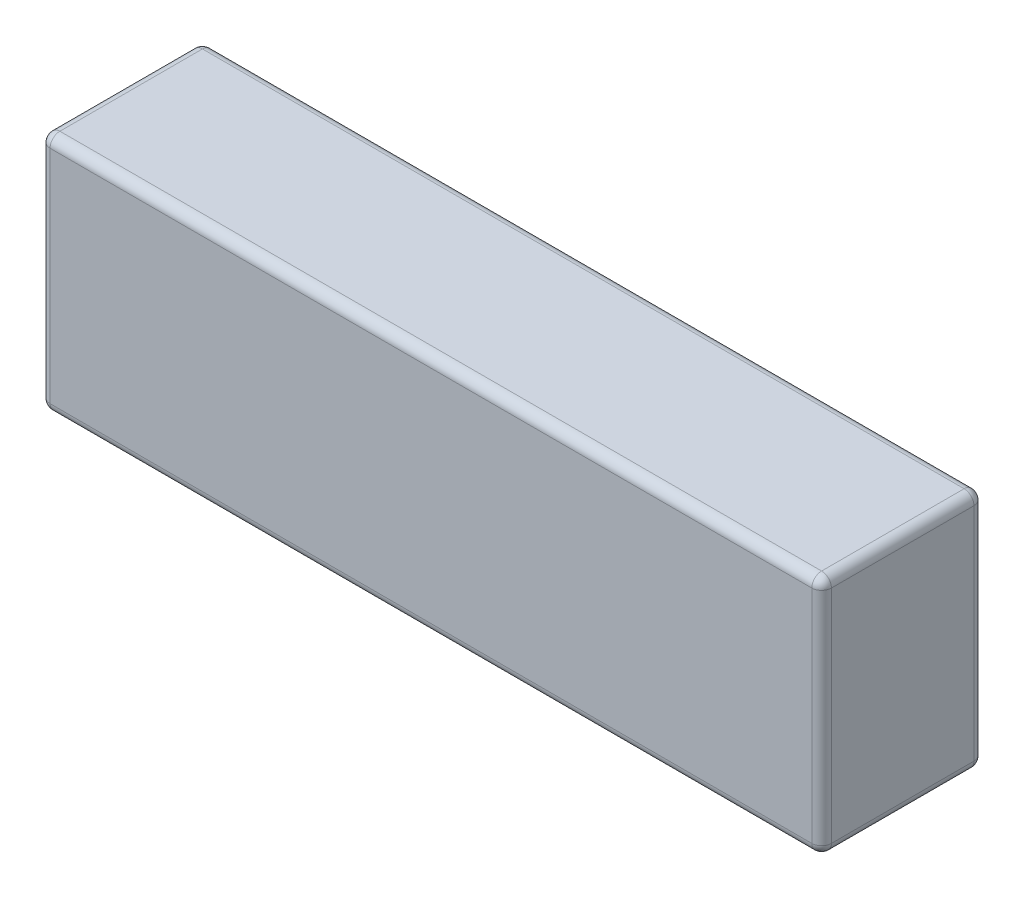
ISO-10303-21;
HEADER;
FILE_DESCRIPTION(('STEP AP214'),'2;1');
FILE_NAME('part.step','',(''),(''),'','','');
FILE_SCHEMA(('AUTOMOTIVE_DESIGN { 1 0 10303 214 1 1 1 1 }'));
ENDSEC;
DATA;
#1=APPLICATION_CONTEXT('core data for automotive mechanical design processes');
#2=APPLICATION_PROTOCOL_DEFINITION('international standard','automotive_design',2000,#1);
#3=PRODUCT_CONTEXT('',#1,'mechanical');
#4=PRODUCT('Part','Part','',(#3));
#5=PRODUCT_RELATED_PRODUCT_CATEGORY('part','',(#4));
#6=PRODUCT_DEFINITION_FORMATION('','',#4);
#7=PRODUCT_DEFINITION_CONTEXT('part definition',#1,'design');
#8=PRODUCT_DEFINITION('design','',#6,#7);
#9=PRODUCT_DEFINITION_SHAPE('','',#8);
#10=(LENGTH_UNIT() NAMED_UNIT(*) SI_UNIT(.MILLI.,.METRE.));
#11=(NAMED_UNIT(*) PLANE_ANGLE_UNIT() SI_UNIT($,.RADIAN.));
#12=(NAMED_UNIT(*) SI_UNIT($,.STERADIAN.) SOLID_ANGLE_UNIT());
#13=UNCERTAINTY_MEASURE_WITH_UNIT(LENGTH_MEASURE(1.E-05),#10,'distance_accuracy_value','');
#14=(GEOMETRIC_REPRESENTATION_CONTEXT(3) GLOBAL_UNCERTAINTY_ASSIGNED_CONTEXT((#13)) GLOBAL_UNIT_ASSIGNED_CONTEXT((#10,
#11,#12)) REPRESENTATION_CONTEXT('',''));
#15=CARTESIAN_POINT('',(0.,0.,0.));
#16=DIRECTION('',(0.,0.,1.));
#17=DIRECTION('',(1.,0.,0.));
#18=AXIS2_PLACEMENT_3D('',#15,#16,#17);
#19=CARTESIAN_POINT('',(0.,49.,0.));
#20=DIRECTION('',(1.,0.,0.));
#21=DIRECTION('',(0.,0.,-1.));
#22=AXIS2_PLACEMENT_3D('',#19,#20,#21);
#23=PLANE('',#22);
#24=DIRECTION('',(0.,0.,1.));
#25=VECTOR('',#24,1.);
#26=CARTESIAN_POINT('',(0.,2.,0.));
#27=LINE('',#26,#25);
#28=CARTESIAN_POINT('',(0.,2.,-31.));
#29=VERTEX_POINT('',#28);
#30=CARTESIAN_POINT('',(0.,2.,-2.));
#31=VERTEX_POINT('',#30);
#32=EDGE_CURVE('E171',#29,#31,#27,.T.);
#33=ORIENTED_EDGE('',*,*,#32,.T.);
#34=DIRECTION('',(0.,-1.,0.));
#35=VECTOR('',#34,1.);
#36=CARTESIAN_POINT('',(0.,49.,-2.));
#37=LINE('',#36,#35);
#38=CARTESIAN_POINT('',(0.,47.,-2.));
#39=VERTEX_POINT('',#38);
#40=EDGE_CURVE('E173',#31,#39,#37,.F.);
#41=ORIENTED_EDGE('',*,*,#40,.T.);
#42=DIRECTION('',(0.,0.,1.));
#43=VECTOR('',#42,1.);
#44=CARTESIAN_POINT('',(0.,47.,0.));
#45=LINE('',#44,#43);
#46=CARTESIAN_POINT('',(0.,47.,-31.));
#47=VERTEX_POINT('',#46);
#48=EDGE_CURVE('E169',#39,#47,#45,.F.);
#49=ORIENTED_EDGE('',*,*,#48,.T.);
#50=DIRECTION('',(0.,-1.,0.));
#51=VECTOR('',#50,1.);
#52=CARTESIAN_POINT('',(0.,49.,-31.));
#53=LINE('',#52,#51);
#54=EDGE_CURVE('E167',#47,#29,#53,.T.);
#55=ORIENTED_EDGE('',*,*,#54,.T.);
#56=EDGE_LOOP('',(#33,#41,#49,#55));
#57=FACE_BOUND('',#56,.T.);
#58=ADVANCED_FACE('F35',(#57),#23,.F.);
#59=CARTESIAN_POINT('',(0.,49.,0.));
#60=DIRECTION('',(0.,0.,-1.));
#61=DIRECTION('',(-1.,0.,0.));
#62=AXIS2_PLACEMENT_3D('',#59,#60,#61);
#63=PLANE('',#62);
#64=DIRECTION('',(0.,-1.,0.));
#65=VECTOR('',#64,1.);
#66=CARTESIAN_POINT('',(2.,49.,0.));
#67=LINE('',#66,#65);
#68=CARTESIAN_POINT('',(2.,47.,0.));
#69=VERTEX_POINT('',#68);
#70=CARTESIAN_POINT('',(2.,2.,0.));
#71=VERTEX_POINT('',#70);
#72=EDGE_CURVE('E134',#69,#71,#67,.T.);
#73=ORIENTED_EDGE('',*,*,#72,.T.);
#74=DIRECTION('',(1.,0.,0.));
#75=VECTOR('',#74,1.);
#76=CARTESIAN_POINT('',(159.,2.,0.));
#77=LINE('',#76,#75);
#78=CARTESIAN_POINT('',(157.,2.,0.));
#79=VERTEX_POINT('',#78);
#80=EDGE_CURVE('E130',#71,#79,#77,.T.);
#81=ORIENTED_EDGE('',*,*,#80,.T.);
#82=DIRECTION('',(0.,-1.,0.));
#83=VECTOR('',#82,1.);
#84=CARTESIAN_POINT('',(157.,49.,0.));
#85=LINE('',#84,#83);
#86=CARTESIAN_POINT('',(157.,47.,0.));
#87=VERTEX_POINT('',#86);
#88=EDGE_CURVE('E122',#79,#87,#85,.F.);
#89=ORIENTED_EDGE('',*,*,#88,.T.);
#90=DIRECTION('',(1.,0.,0.));
#91=VECTOR('',#90,1.);
#92=CARTESIAN_POINT('',(0.,47.,0.));
#93=LINE('',#92,#91);
#94=EDGE_CURVE('E127',#87,#69,#93,.F.);
#95=ORIENTED_EDGE('',*,*,#94,.T.);
#96=EDGE_LOOP('',(#73,#81,#89,#95));
#97=FACE_BOUND('',#96,.T.);
#98=ADVANCED_FACE('F125',(#97),#63,.F.);
#99=CARTESIAN_POINT('',(159.,49.,0.));
#100=DIRECTION('',(-1.,0.,0.));
#101=DIRECTION('',(0.,0.,1.));
#102=AXIS2_PLACEMENT_3D('',#99,#100,#101);
#103=PLANE('',#102);
#104=DIRECTION('',(0.,0.,-1.));
#105=VECTOR('',#104,1.);
#106=CARTESIAN_POINT('',(159.,47.,0.));
#107=LINE('',#106,#105);
#108=CARTESIAN_POINT('',(159.,47.,-31.));
#109=VERTEX_POINT('',#108);
#110=CARTESIAN_POINT('',(159.,47.,-2.));
#111=VERTEX_POINT('',#110);
#112=EDGE_CURVE('E178',#109,#111,#107,.F.);
#113=ORIENTED_EDGE('',*,*,#112,.T.);
#114=DIRECTION('',(0.,-1.,0.));
#115=VECTOR('',#114,1.);
#116=CARTESIAN_POINT('',(159.,49.,-2.));
#117=LINE('',#116,#115);
#118=CARTESIAN_POINT('',(159.,2.,-2.));
#119=VERTEX_POINT('',#118);
#120=EDGE_CURVE('E142',#111,#119,#117,.T.);
#121=ORIENTED_EDGE('',*,*,#120,.T.);
#122=DIRECTION('',(0.,0.,-1.));
#123=VECTOR('',#122,1.);
#124=CARTESIAN_POINT('',(159.,2.,-33.));
#125=LINE('',#124,#123);
#126=CARTESIAN_POINT('',(159.,2.,-31.));
#127=VERTEX_POINT('',#126);
#128=EDGE_CURVE('E180',#119,#127,#125,.T.);
#129=ORIENTED_EDGE('',*,*,#128,.T.);
#130=DIRECTION('',(0.,-1.,0.));
#131=VECTOR('',#130,1.);
#132=CARTESIAN_POINT('',(159.,49.,-31.));
#133=LINE('',#132,#131);
#134=EDGE_CURVE('E176',#127,#109,#133,.F.);
#135=ORIENTED_EDGE('',*,*,#134,.T.);
#136=EDGE_LOOP('',(#113,#121,#129,#135));
#137=FACE_BOUND('',#136,.T.);
#138=ADVANCED_FACE('F334',(#137),#103,.F.);
#139=CARTESIAN_POINT('',(0.,49.,-33.));
#140=DIRECTION('',(0.,0.,1.));
#141=DIRECTION('',(1.,0.,0.));
#142=AXIS2_PLACEMENT_3D('',#139,#140,#141);
#143=PLANE('',#142);
#144=DIRECTION('',(-1.,0.,0.));
#145=VECTOR('',#144,1.);
#146=CARTESIAN_POINT('',(0.,47.,-33.));
#147=LINE('',#146,#145);
#148=CARTESIAN_POINT('',(2.,47.,-33.));
#149=VERTEX_POINT('',#148);
#150=CARTESIAN_POINT('',(157.,47.,-33.));
#151=VERTEX_POINT('',#150);
#152=EDGE_CURVE('E44',#149,#151,#147,.F.);
#153=ORIENTED_EDGE('',*,*,#152,.T.);
#154=DIRECTION('',(0.,-1.,0.));
#155=VECTOR('',#154,1.);
#156=CARTESIAN_POINT('',(157.,49.,-33.));
#157=LINE('',#156,#155);
#158=CARTESIAN_POINT('',(157.,2.,-33.));
#159=VERTEX_POINT('',#158);
#160=EDGE_CURVE('E11',#151,#159,#157,.T.);
#161=ORIENTED_EDGE('',*,*,#160,.T.);
#162=DIRECTION('',(-1.,0.,0.));
#163=VECTOR('',#162,1.);
#164=CARTESIAN_POINT('',(0.,2.,-33.));
#165=LINE('',#164,#163);
#166=CARTESIAN_POINT('',(2.,2.,-33.));
#167=VERTEX_POINT('',#166);
#168=EDGE_CURVE('E201',#159,#167,#165,.T.);
#169=ORIENTED_EDGE('',*,*,#168,.T.);
#170=DIRECTION('',(0.,-1.,0.));
#171=VECTOR('',#170,1.);
#172=CARTESIAN_POINT('',(2.,49.,-33.));
#173=LINE('',#172,#171);
#174=EDGE_CURVE('E55',#167,#149,#173,.F.);
#175=ORIENTED_EDGE('',*,*,#174,.T.);
#176=EDGE_LOOP('',(#153,#161,#169,#175));
#177=FACE_BOUND('',#176,.T.);
#178=ADVANCED_FACE('F274',(#177),#143,.F.);
#179=CARTESIAN_POINT('',(0.,49.,-33.));
#180=DIRECTION('',(0.,-1.,0.));
#181=DIRECTION('',(0.,0.,-1.));
#182=AXIS2_PLACEMENT_3D('',#179,#180,#181);
#183=PLANE('',#182);
#184=DIRECTION('',(1.,0.,0.));
#185=VECTOR('',#184,1.);
#186=CARTESIAN_POINT('',(0.,49.,-2.));
#187=LINE('',#186,#185);
#188=CARTESIAN_POINT('',(2.,49.,-2.));
#189=VERTEX_POINT('',#188);
#190=CARTESIAN_POINT('',(157.,49.,-2.));
#191=VERTEX_POINT('',#190);
#192=EDGE_CURVE('E196',#189,#191,#187,.T.);
#193=ORIENTED_EDGE('',*,*,#192,.T.);
#194=DIRECTION('',(0.,0.,-1.));
#195=VECTOR('',#194,1.);
#196=CARTESIAN_POINT('',(157.,49.,-33.));
#197=LINE('',#196,#195);
#198=CARTESIAN_POINT('',(157.,49.,-31.));
#199=VERTEX_POINT('',#198);
#200=EDGE_CURVE('E198',#191,#199,#197,.T.);
#201=ORIENTED_EDGE('',*,*,#200,.T.);
#202=DIRECTION('',(-1.,0.,0.));
#203=VECTOR('',#202,1.);
#204=CARTESIAN_POINT('',(0.,49.,-31.));
#205=LINE('',#204,#203);
#206=CARTESIAN_POINT('',(2.,49.,-31.));
#207=VERTEX_POINT('',#206);
#208=EDGE_CURVE('E192',#199,#207,#205,.T.);
#209=ORIENTED_EDGE('',*,*,#208,.T.);
#210=DIRECTION('',(0.,0.,1.));
#211=VECTOR('',#210,1.);
#212=CARTESIAN_POINT('',(2.,49.,-33.));
#213=LINE('',#212,#211);
#214=EDGE_CURVE('E194',#207,#189,#213,.T.);
#215=ORIENTED_EDGE('',*,*,#214,.T.);
#216=EDGE_LOOP('',(#193,#201,#209,#215));
#217=FACE_BOUND('',#216,.T.);
#218=ADVANCED_FACE('F298',(#217),#183,.F.);
#219=CARTESIAN_POINT('',(0.,0.,-33.));
#220=DIRECTION('',(0.,-1.,0.));
#221=DIRECTION('',(0.,0.,-1.));
#222=AXIS2_PLACEMENT_3D('',#219,#220,#221);
#223=PLANE('',#222);
#224=DIRECTION('',(0.,0.,-1.));
#225=VECTOR('',#224,1.);
#226=CARTESIAN_POINT('',(157.,0.,0.));
#227=LINE('',#226,#225);
#228=CARTESIAN_POINT('',(157.,0.,-31.));
#229=VERTEX_POINT('',#228);
#230=CARTESIAN_POINT('',(157.,0.,-2.));
#231=VERTEX_POINT('',#230);
#232=EDGE_CURVE('E187',#229,#231,#227,.F.);
#233=ORIENTED_EDGE('',*,*,#232,.T.);
#234=DIRECTION('',(1.,0.,0.));
#235=VECTOR('',#234,1.);
#236=CARTESIAN_POINT('',(0.,0.,-2.));
#237=LINE('',#236,#235);
#238=CARTESIAN_POINT('',(2.,0.,-2.));
#239=VERTEX_POINT('',#238);
#240=EDGE_CURVE('E189',#231,#239,#237,.F.);
#241=ORIENTED_EDGE('',*,*,#240,.T.);
#242=DIRECTION('',(0.,0.,1.));
#243=VECTOR('',#242,1.);
#244=CARTESIAN_POINT('',(2.,0.,-33.));
#245=LINE('',#244,#243);
#246=CARTESIAN_POINT('',(2.,0.,-31.));
#247=VERTEX_POINT('',#246);
#248=EDGE_CURVE('E185',#239,#247,#245,.F.);
#249=ORIENTED_EDGE('',*,*,#248,.T.);
#250=DIRECTION('',(-1.,0.,0.));
#251=VECTOR('',#250,1.);
#252=CARTESIAN_POINT('',(159.,0.,-31.));
#253=LINE('',#252,#251);
#254=EDGE_CURVE('E183',#247,#229,#253,.F.);
#255=ORIENTED_EDGE('',*,*,#254,.T.);
#256=EDGE_LOOP('',(#233,#241,#249,#255));
#257=FACE_BOUND('',#256,.T.);
#258=ADVANCED_FACE('F267',(#257),#223,.T.);
#259=CARTESIAN_POINT('',(157.,49.,-31.));
#260=DIRECTION('',(0.,-1.,0.));
#261=DIRECTION('',(0.,0.,-1.));
#262=AXIS2_PLACEMENT_3D('',#259,#260,#261);
#263=CYLINDRICAL_SURFACE('',#262,2.);
#264=CARTESIAN_POINT('',(157.,47.,-31.));
#265=DIRECTION('',(0.,1.,0.));
#266=DIRECTION('',(0.,0.,1.));
#267=AXIS2_PLACEMENT_3D('',#264,#265,#266);
#268=CIRCLE('',#267,2.);
#269=EDGE_CURVE('E39',#109,#151,#268,.T.);
#270=ORIENTED_EDGE('',*,*,#269,.F.);
#271=ORIENTED_EDGE('',*,*,#134,.F.);
#272=CARTESIAN_POINT('',(157.,2.,-31.));
#273=DIRECTION('',(0.,-1.,0.));
#274=DIRECTION('',(0.,0.,-1.));
#275=AXIS2_PLACEMENT_3D('',#272,#273,#274);
#276=CIRCLE('',#275,2.);
#277=EDGE_CURVE('E163',#159,#127,#276,.T.);
#278=ORIENTED_EDGE('',*,*,#277,.F.);
#279=ORIENTED_EDGE('',*,*,#160,.F.);
#280=EDGE_LOOP('',(#270,#271,#278,#279));
#281=FACE_BOUND('',#280,.T.);
#282=ADVANCED_FACE('F37',(#281),#263,.T.);
#283=CARTESIAN_POINT('',(157.,47.,-31.));
#284=DIRECTION('',(0.,0.,1.));
#285=DIRECTION('',(1.,0.,0.));
#286=AXIS2_PLACEMENT_3D('',#283,#284,#285);
#287=SPHERICAL_SURFACE('',#286,2.);
#288=CARTESIAN_POINT('',(157.,47.,-31.));
#289=DIRECTION('',(0.,0.,-1.));
#290=DIRECTION('',(-1.,0.,0.));
#291=AXIS2_PLACEMENT_3D('',#288,#289,#290);
#292=CIRCLE('',#291,2.);
#293=EDGE_CURVE('E247',#109,#199,#292,.F.);
#294=ORIENTED_EDGE('',*,*,#293,.F.);
#295=ORIENTED_EDGE('',*,*,#269,.T.);
#296=CARTESIAN_POINT('',(157.,47.,-31.));
#297=DIRECTION('',(1.,0.,0.));
#298=DIRECTION('',(0.,0.,-1.));
#299=AXIS2_PLACEMENT_3D('',#296,#297,#298);
#300=CIRCLE('',#299,2.);
#301=EDGE_CURVE('E250',#199,#151,#300,.F.);
#302=ORIENTED_EDGE('',*,*,#301,.F.);
#303=EDGE_LOOP('',(#294,#295,#302));
#304=FACE_BOUND('',#303,.T.);
#305=ADVANCED_FACE('F291',(#304),#287,.T.);
#306=CARTESIAN_POINT('',(157.,2.,-31.));
#307=DIRECTION('',(0.,0.,1.));
#308=DIRECTION('',(1.,0.,0.));
#309=AXIS2_PLACEMENT_3D('',#306,#307,#308);
#310=SPHERICAL_SURFACE('',#309,2.);
#311=CARTESIAN_POINT('',(157.,2.,-31.));
#312=DIRECTION('',(1.,0.,0.));
#313=DIRECTION('',(0.,0.,-1.));
#314=AXIS2_PLACEMENT_3D('',#311,#312,#313);
#315=CIRCLE('',#314,2.);
#316=EDGE_CURVE('E241',#159,#229,#315,.F.);
#317=ORIENTED_EDGE('',*,*,#316,.F.);
#318=ORIENTED_EDGE('',*,*,#277,.T.);
#319=CARTESIAN_POINT('',(157.,2.,-31.));
#320=DIRECTION('',(0.,0.,-1.));
#321=DIRECTION('',(-1.,0.,0.));
#322=AXIS2_PLACEMENT_3D('',#319,#320,#321);
#323=CIRCLE('',#322,2.);
#324=EDGE_CURVE('E244',#229,#127,#323,.F.);
#325=ORIENTED_EDGE('',*,*,#324,.F.);
#326=EDGE_LOOP('',(#317,#318,#325));
#327=FACE_BOUND('',#326,.T.);
#328=ADVANCED_FACE('F257',(#327),#310,.T.);
#329=CARTESIAN_POINT('',(0.,47.,-31.));
#330=DIRECTION('',(-1.,0.,0.));
#331=DIRECTION('',(0.,0.,1.));
#332=AXIS2_PLACEMENT_3D('',#329,#330,#331);
#333=CYLINDRICAL_SURFACE('',#332,2.);
#334=ORIENTED_EDGE('',*,*,#301,.T.);
#335=ORIENTED_EDGE('',*,*,#152,.F.);
#336=CARTESIAN_POINT('',(2.,47.,-31.));
#337=DIRECTION('',(-1.,0.,0.));
#338=DIRECTION('',(0.,0.,1.));
#339=AXIS2_PLACEMENT_3D('',#336,#337,#338);
#340=CIRCLE('',#339,2.);
#341=EDGE_CURVE('E235',#207,#149,#340,.T.);
#342=ORIENTED_EDGE('',*,*,#341,.F.);
#343=ORIENTED_EDGE('',*,*,#208,.F.);
#344=EDGE_LOOP('',(#334,#335,#342,#343));
#345=FACE_BOUND('',#344,.T.);
#346=ADVANCED_FACE('F287',(#345),#333,.T.);
#347=CARTESIAN_POINT('',(157.,47.,-33.));
#348=DIRECTION('',(0.,0.,-1.));
#349=DIRECTION('',(-1.,0.,0.));
#350=AXIS2_PLACEMENT_3D('',#347,#348,#349);
#351=CYLINDRICAL_SURFACE('',#350,2.);
#352=ORIENTED_EDGE('',*,*,#293,.T.);
#353=ORIENTED_EDGE('',*,*,#200,.F.);
#354=CARTESIAN_POINT('',(157.,47.,-2.));
#355=DIRECTION('',(0.,0.,1.));
#356=DIRECTION('',(0.,-1.,0.));
#357=AXIS2_PLACEMENT_3D('',#354,#355,#356);
#358=CIRCLE('',#357,2.);
#359=EDGE_CURVE('E146',#111,#191,#358,.T.);
#360=ORIENTED_EDGE('',*,*,#359,.F.);
#361=ORIENTED_EDGE('',*,*,#112,.F.);
#362=EDGE_LOOP('',(#352,#353,#360,#361));
#363=FACE_BOUND('',#362,.T.);
#364=ADVANCED_FACE('F296',(#363),#351,.T.);
#365=CARTESIAN_POINT('',(157.,49.,-2.));
#366=DIRECTION('',(0.,-1.,0.));
#367=DIRECTION('',(0.,0.,-1.));
#368=AXIS2_PLACEMENT_3D('',#365,#366,#367);
#369=CYLINDRICAL_SURFACE('',#368,2.);
#370=CARTESIAN_POINT('',(157.,2.,-2.));
#371=DIRECTION('',(0.,-1.,0.));
#372=DIRECTION('',(0.,0.,-1.));
#373=AXIS2_PLACEMENT_3D('',#370,#371,#372);
#374=CIRCLE('',#373,2.);
#375=EDGE_CURVE('E147',#119,#79,#374,.T.);
#376=ORIENTED_EDGE('',*,*,#375,.F.);
#377=ORIENTED_EDGE('',*,*,#120,.F.);
#378=CARTESIAN_POINT('',(157.,47.,-2.));
#379=DIRECTION('',(0.,1.,0.));
#380=DIRECTION('',(0.,0.,1.));
#381=AXIS2_PLACEMENT_3D('',#378,#379,#380);
#382=CIRCLE('',#381,2.);
#383=EDGE_CURVE('E138',#87,#111,#382,.T.);
#384=ORIENTED_EDGE('',*,*,#383,.F.);
#385=ORIENTED_EDGE('',*,*,#88,.F.);
#386=EDGE_LOOP('',(#376,#377,#384,#385));
#387=FACE_BOUND('',#386,.T.);
#388=ADVANCED_FACE('F140',(#387),#369,.T.);
#389=CARTESIAN_POINT('',(157.,2.,0.));
#390=DIRECTION('',(0.,0.,1.));
#391=DIRECTION('',(1.,0.,0.));
#392=AXIS2_PLACEMENT_3D('',#389,#390,#391);
#393=CYLINDRICAL_SURFACE('',#392,2.);
#394=ORIENTED_EDGE('',*,*,#324,.T.);
#395=ORIENTED_EDGE('',*,*,#128,.F.);
#396=CARTESIAN_POINT('',(157.,2.,-2.));
#397=DIRECTION('',(0.,0.,1.));
#398=DIRECTION('',(1.,0.,0.));
#399=AXIS2_PLACEMENT_3D('',#396,#397,#398);
#400=CIRCLE('',#399,2.);
#401=EDGE_CURVE('E231',#231,#119,#400,.T.);
#402=ORIENTED_EDGE('',*,*,#401,.F.);
#403=ORIENTED_EDGE('',*,*,#232,.F.);
#404=EDGE_LOOP('',(#394,#395,#402,#403));
#405=FACE_BOUND('',#404,.T.);
#406=ADVANCED_FACE('F263',(#405),#393,.T.);
#407=CARTESIAN_POINT('',(0.,2.,-31.));
#408=DIRECTION('',(1.,0.,0.));
#409=DIRECTION('',(0.,0.,-1.));
#410=AXIS2_PLACEMENT_3D('',#407,#408,#409);
#411=CYLINDRICAL_SURFACE('',#410,2.);
#412=ORIENTED_EDGE('',*,*,#316,.T.);
#413=ORIENTED_EDGE('',*,*,#254,.F.);
#414=CARTESIAN_POINT('',(2.,2.,-31.));
#415=DIRECTION('',(-1.,0.,0.));
#416=DIRECTION('',(0.,0.,1.));
#417=AXIS2_PLACEMENT_3D('',#414,#415,#416);
#418=CIRCLE('',#417,2.);
#419=EDGE_CURVE('E228',#167,#247,#418,.T.);
#420=ORIENTED_EDGE('',*,*,#419,.F.);
#421=ORIENTED_EDGE('',*,*,#168,.F.);
#422=EDGE_LOOP('',(#412,#413,#420,#421));
#423=FACE_BOUND('',#422,.T.);
#424=ADVANCED_FACE('F273',(#423),#411,.T.);
#425=CARTESIAN_POINT('',(2.,49.,-31.));
#426=DIRECTION('',(0.,-1.,0.));
#427=DIRECTION('',(0.,0.,-1.));
#428=AXIS2_PLACEMENT_3D('',#425,#426,#427);
#429=CYLINDRICAL_SURFACE('',#428,2.);
#430=CARTESIAN_POINT('',(2.,47.,-31.));
#431=DIRECTION('',(0.,1.,0.));
#432=DIRECTION('',(0.,0.,1.));
#433=AXIS2_PLACEMENT_3D('',#430,#431,#432);
#434=CIRCLE('',#433,2.);
#435=EDGE_CURVE('E238',#149,#47,#434,.T.);
#436=ORIENTED_EDGE('',*,*,#435,.F.);
#437=ORIENTED_EDGE('',*,*,#174,.F.);
#438=CARTESIAN_POINT('',(2.,2.,-31.));
#439=DIRECTION('',(0.,-1.,0.));
#440=DIRECTION('',(0.,0.,-1.));
#441=AXIS2_PLACEMENT_3D('',#438,#439,#440);
#442=CIRCLE('',#441,2.);
#443=EDGE_CURVE('E225',#29,#167,#442,.T.);
#444=ORIENTED_EDGE('',*,*,#443,.F.);
#445=ORIENTED_EDGE('',*,*,#54,.F.);
#446=EDGE_LOOP('',(#436,#437,#444,#445));
#447=FACE_BOUND('',#446,.T.);
#448=ADVANCED_FACE('F278',(#447),#429,.T.);
#449=CARTESIAN_POINT('',(2.,47.,-31.));
#450=DIRECTION('',(0.,0.,1.));
#451=DIRECTION('',(1.,0.,0.));
#452=AXIS2_PLACEMENT_3D('',#449,#450,#451);
#453=SPHERICAL_SURFACE('',#452,2.);
#454=ORIENTED_EDGE('',*,*,#341,.T.);
#455=ORIENTED_EDGE('',*,*,#435,.T.);
#456=CARTESIAN_POINT('',(2.,47.,-31.));
#457=DIRECTION('',(0.,0.,-1.));
#458=DIRECTION('',(-1.,0.,0.));
#459=AXIS2_PLACEMENT_3D('',#456,#457,#458);
#460=CIRCLE('',#459,2.);
#461=EDGE_CURVE('E154',#207,#47,#460,.F.);
#462=ORIENTED_EDGE('',*,*,#461,.F.);
#463=EDGE_LOOP('',(#454,#455,#462));
#464=FACE_BOUND('',#463,.T.);
#465=ADVANCED_FACE('F284',(#464),#453,.T.);
#466=CARTESIAN_POINT('',(157.,47.,-2.));
#467=DIRECTION('',(0.,0.,1.));
#468=DIRECTION('',(1.,0.,0.));
#469=AXIS2_PLACEMENT_3D('',#466,#467,#468);
#470=SPHERICAL_SURFACE('',#469,2.);
#471=ORIENTED_EDGE('',*,*,#383,.T.);
#472=ORIENTED_EDGE('',*,*,#359,.T.);
#473=CARTESIAN_POINT('',(157.,47.,-2.));
#474=DIRECTION('',(1.,0.,0.));
#475=DIRECTION('',(0.,0.,-1.));
#476=AXIS2_PLACEMENT_3D('',#473,#474,#475);
#477=CIRCLE('',#476,2.);
#478=EDGE_CURVE('E150',#87,#191,#477,.F.);
#479=ORIENTED_EDGE('',*,*,#478,.F.);
#480=EDGE_LOOP('',(#471,#472,#479));
#481=FACE_BOUND('',#480,.T.);
#482=ADVANCED_FACE('F151',(#481),#470,.T.);
#483=CARTESIAN_POINT('',(157.,2.,-2.));
#484=DIRECTION('',(0.,0.,1.));
#485=DIRECTION('',(1.,0.,0.));
#486=AXIS2_PLACEMENT_3D('',#483,#484,#485);
#487=SPHERICAL_SURFACE('',#486,2.);
#488=ORIENTED_EDGE('',*,*,#401,.T.);
#489=ORIENTED_EDGE('',*,*,#375,.T.);
#490=CARTESIAN_POINT('',(157.,2.,-2.));
#491=DIRECTION('',(1.,0.,0.));
#492=DIRECTION('',(0.,0.,-1.));
#493=AXIS2_PLACEMENT_3D('',#490,#491,#492);
#494=CIRCLE('',#493,2.);
#495=EDGE_CURVE('E155',#231,#79,#494,.F.);
#496=ORIENTED_EDGE('',*,*,#495,.F.);
#497=EDGE_LOOP('',(#488,#489,#496));
#498=FACE_BOUND('',#497,.T.);
#499=ADVANCED_FACE('F317',(#498),#487,.T.);
#500=CARTESIAN_POINT('',(2.,2.,-31.));
#501=DIRECTION('',(0.,0.,1.));
#502=DIRECTION('',(1.,0.,0.));
#503=AXIS2_PLACEMENT_3D('',#500,#501,#502);
#504=SPHERICAL_SURFACE('',#503,2.);
#505=ORIENTED_EDGE('',*,*,#443,.T.);
#506=ORIENTED_EDGE('',*,*,#419,.T.);
#507=CARTESIAN_POINT('',(2.,2.,-31.));
#508=DIRECTION('',(0.,0.,-1.));
#509=DIRECTION('',(-1.,0.,0.));
#510=AXIS2_PLACEMENT_3D('',#507,#508,#509);
#511=CIRCLE('',#510,2.);
#512=EDGE_CURVE('E218',#29,#247,#511,.F.);
#513=ORIENTED_EDGE('',*,*,#512,.F.);
#514=EDGE_LOOP('',(#505,#506,#513));
#515=FACE_BOUND('',#514,.T.);
#516=ADVANCED_FACE('F319',(#515),#504,.T.);
#517=CARTESIAN_POINT('',(2.,47.,-33.));
#518=DIRECTION('',(0.,0.,1.));
#519=DIRECTION('',(1.,0.,0.));
#520=AXIS2_PLACEMENT_3D('',#517,#518,#519);
#521=CYLINDRICAL_SURFACE('',#520,2.);
#522=ORIENTED_EDGE('',*,*,#461,.T.);
#523=ORIENTED_EDGE('',*,*,#48,.F.);
#524=CARTESIAN_POINT('',(2.,47.,-2.));
#525=DIRECTION('',(0.,0.,1.));
#526=DIRECTION('',(1.,0.,0.));
#527=AXIS2_PLACEMENT_3D('',#524,#525,#526);
#528=CIRCLE('',#527,2.);
#529=EDGE_CURVE('E215',#189,#39,#528,.T.);
#530=ORIENTED_EDGE('',*,*,#529,.F.);
#531=ORIENTED_EDGE('',*,*,#214,.F.);
#532=EDGE_LOOP('',(#522,#523,#530,#531));
#533=FACE_BOUND('',#532,.T.);
#534=ADVANCED_FACE('F302',(#533),#521,.T.);
#535=CARTESIAN_POINT('',(0.,47.,-2.));
#536=DIRECTION('',(1.,0.,0.));
#537=DIRECTION('',(0.,0.,-1.));
#538=AXIS2_PLACEMENT_3D('',#535,#536,#537);
#539=CYLINDRICAL_SURFACE('',#538,2.);
#540=ORIENTED_EDGE('',*,*,#478,.T.);
#541=ORIENTED_EDGE('',*,*,#192,.F.);
#542=CARTESIAN_POINT('',(2.,47.,-2.));
#543=DIRECTION('',(-1.,0.,0.));
#544=DIRECTION('',(0.,0.,1.));
#545=AXIS2_PLACEMENT_3D('',#542,#543,#544);
#546=CIRCLE('',#545,2.);
#547=EDGE_CURVE('E159',#69,#189,#546,.T.);
#548=ORIENTED_EDGE('',*,*,#547,.F.);
#549=ORIENTED_EDGE('',*,*,#94,.F.);
#550=EDGE_LOOP('',(#540,#541,#548,#549));
#551=FACE_BOUND('',#550,.T.);
#552=ADVANCED_FACE('F157',(#551),#539,.T.);
#553=CARTESIAN_POINT('',(0.,2.,-2.));
#554=DIRECTION('',(-1.,0.,0.));
#555=DIRECTION('',(0.,0.,1.));
#556=AXIS2_PLACEMENT_3D('',#553,#554,#555);
#557=CYLINDRICAL_SURFACE('',#556,2.);
#558=ORIENTED_EDGE('',*,*,#495,.T.);
#559=ORIENTED_EDGE('',*,*,#80,.F.);
#560=CARTESIAN_POINT('',(2.,2.,-2.));
#561=DIRECTION('',(-1.,0.,0.));
#562=DIRECTION('',(0.,0.,1.));
#563=AXIS2_PLACEMENT_3D('',#560,#561,#562);
#564=CIRCLE('',#563,2.);
#565=EDGE_CURVE('E211',#239,#71,#564,.T.);
#566=ORIENTED_EDGE('',*,*,#565,.F.);
#567=ORIENTED_EDGE('',*,*,#240,.F.);
#568=EDGE_LOOP('',(#558,#559,#566,#567));
#569=FACE_BOUND('',#568,.T.);
#570=ADVANCED_FACE('F315',(#569),#557,.T.);
#571=CARTESIAN_POINT('',(2.,2.,0.));
#572=DIRECTION('',(0.,0.,-1.));
#573=DIRECTION('',(-1.,0.,0.));
#574=AXIS2_PLACEMENT_3D('',#571,#572,#573);
#575=CYLINDRICAL_SURFACE('',#574,2.);
#576=ORIENTED_EDGE('',*,*,#512,.T.);
#577=ORIENTED_EDGE('',*,*,#248,.F.);
#578=CARTESIAN_POINT('',(2.,2.,-2.));
#579=DIRECTION('',(0.,0.,1.));
#580=DIRECTION('',(1.,0.,0.));
#581=AXIS2_PLACEMENT_3D('',#578,#579,#580);
#582=CIRCLE('',#581,2.);
#583=EDGE_CURVE('E209',#31,#239,#582,.T.);
#584=ORIENTED_EDGE('',*,*,#583,.F.);
#585=ORIENTED_EDGE('',*,*,#32,.F.);
#586=EDGE_LOOP('',(#576,#577,#584,#585));
#587=FACE_BOUND('',#586,.T.);
#588=ADVANCED_FACE('F344',(#587),#575,.T.);
#589=CARTESIAN_POINT('',(2.,47.,-2.));
#590=DIRECTION('',(0.,0.,1.));
#591=DIRECTION('',(1.,0.,0.));
#592=AXIS2_PLACEMENT_3D('',#589,#590,#591);
#593=SPHERICAL_SURFACE('',#592,2.);
#594=ORIENTED_EDGE('',*,*,#547,.T.);
#595=ORIENTED_EDGE('',*,*,#529,.T.);
#596=CARTESIAN_POINT('',(2.,47.,-2.));
#597=DIRECTION('',(0.,1.,0.));
#598=DIRECTION('',(0.,0.,1.));
#599=AXIS2_PLACEMENT_3D('',#596,#597,#598);
#600=CIRCLE('',#599,2.);
#601=EDGE_CURVE('E207',#69,#39,#600,.F.);
#602=ORIENTED_EDGE('',*,*,#601,.F.);
#603=EDGE_LOOP('',(#594,#595,#602));
#604=FACE_BOUND('',#603,.T.);
#605=ADVANCED_FACE('F304',(#604),#593,.T.);
#606=CARTESIAN_POINT('',(2.,2.,-2.));
#607=DIRECTION('',(0.,0.,1.));
#608=DIRECTION('',(1.,0.,0.));
#609=AXIS2_PLACEMENT_3D('',#606,#607,#608);
#610=SPHERICAL_SURFACE('',#609,2.);
#611=ORIENTED_EDGE('',*,*,#583,.T.);
#612=ORIENTED_EDGE('',*,*,#565,.T.);
#613=CARTESIAN_POINT('',(2.,2.,-2.));
#614=DIRECTION('',(0.,-1.,0.));
#615=DIRECTION('',(0.,0.,-1.));
#616=AXIS2_PLACEMENT_3D('',#613,#614,#615);
#617=CIRCLE('',#616,2.);
#618=EDGE_CURVE('E205',#31,#71,#617,.F.);
#619=ORIENTED_EDGE('',*,*,#618,.F.);
#620=EDGE_LOOP('',(#611,#612,#619));
#621=FACE_BOUND('',#620,.T.);
#622=ADVANCED_FACE('F312',(#621),#610,.T.);
#623=CARTESIAN_POINT('',(2.,49.,-2.));
#624=DIRECTION('',(0.,-1.,0.));
#625=DIRECTION('',(0.,0.,-1.));
#626=AXIS2_PLACEMENT_3D('',#623,#624,#625);
#627=CYLINDRICAL_SURFACE('',#626,2.);
#628=ORIENTED_EDGE('',*,*,#601,.T.);
#629=ORIENTED_EDGE('',*,*,#40,.F.);
#630=ORIENTED_EDGE('',*,*,#618,.T.);
#631=ORIENTED_EDGE('',*,*,#72,.F.);
#632=EDGE_LOOP('',(#628,#629,#630,#631));
#633=FACE_BOUND('',#632,.T.);
#634=ADVANCED_FACE('F308',(#633),#627,.T.);
#635=CLOSED_SHELL('',(#58,#98,#138,#178,#218,#258,#282,#305,#328,#346,#364,#388,#406,#424,#448,
#465,#482,#499,#516,#534,#552,#570,#588,#605,#622,#634));
#636=MANIFOLD_SOLID_BREP('B2',#635);
#637=ADVANCED_BREP_SHAPE_REPRESENTATION('',(#18,#636),#14);
#638=SHAPE_DEFINITION_REPRESENTATION(#9,#637);
ENDSEC;
END-ISO-10303-21;
